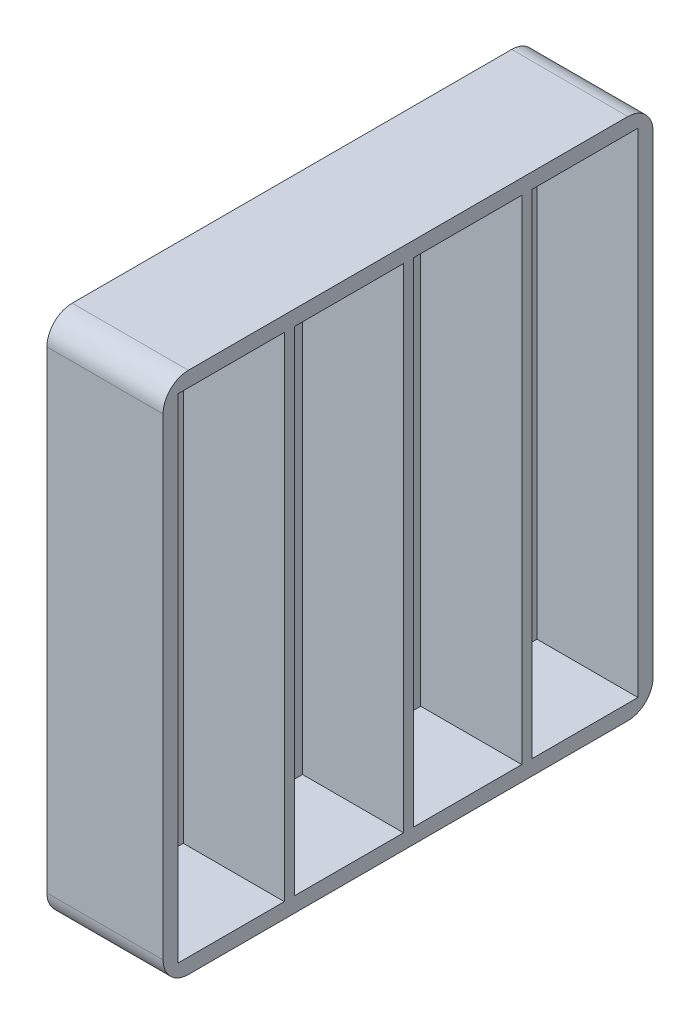
ISO-10303-21;
HEADER;
FILE_DESCRIPTION(('STEP AP214'),'2;1');
FILE_NAME('part.step','',(''),(''),'','','');
FILE_SCHEMA(('AUTOMOTIVE_DESIGN { 1 0 10303 214 1 1 1 1 }'));
ENDSEC;
DATA;
#1=APPLICATION_CONTEXT('core data for automotive mechanical design processes');
#2=APPLICATION_PROTOCOL_DEFINITION('international standard','automotive_design',2000,#1);
#3=PRODUCT_CONTEXT('',#1,'mechanical');
#4=PRODUCT('Part','Part','',(#3));
#5=PRODUCT_RELATED_PRODUCT_CATEGORY('part','',(#4));
#6=PRODUCT_DEFINITION_FORMATION('','',#4);
#7=PRODUCT_DEFINITION_CONTEXT('part definition',#1,'design');
#8=PRODUCT_DEFINITION('design','',#6,#7);
#9=PRODUCT_DEFINITION_SHAPE('','',#8);
#10=(LENGTH_UNIT() NAMED_UNIT(*) SI_UNIT(.MILLI.,.METRE.));
#11=(NAMED_UNIT(*) PLANE_ANGLE_UNIT() SI_UNIT($,.RADIAN.));
#12=(NAMED_UNIT(*) SI_UNIT($,.STERADIAN.) SOLID_ANGLE_UNIT());
#13=UNCERTAINTY_MEASURE_WITH_UNIT(LENGTH_MEASURE(1.E-05),#10,'distance_accuracy_value','');
#14=(GEOMETRIC_REPRESENTATION_CONTEXT(3) GLOBAL_UNCERTAINTY_ASSIGNED_CONTEXT((#13)) GLOBAL_UNIT_ASSIGNED_CONTEXT((#10,
#11,#12)) REPRESENTATION_CONTEXT('',''));
#15=CARTESIAN_POINT('',(0.,0.,0.));
#16=DIRECTION('',(0.,0.,1.));
#17=DIRECTION('',(1.,0.,0.));
#18=AXIS2_PLACEMENT_3D('',#15,#16,#17);
#19=CARTESIAN_POINT('',(1.5,25.9,24.25));
#20=DIRECTION('',(1.,0.,0.));
#21=DIRECTION('',(0.,0.,-1.));
#22=AXIS2_PLACEMENT_3D('',#19,#20,#21);
#23=PLANE('',#22);
#24=DIRECTION('',(0.,1.,0.));
#25=VECTOR('',#24,1.);
#26=CARTESIAN_POINT('',(1.5,1.5,23.7));
#27=LINE('',#26,#25);
#28=CARTESIAN_POINT('',(1.5,1.5,23.7));
#29=VERTEX_POINT('',#28);
#30=CARTESIAN_POINT('',(1.5,50.3,23.7));
#31=VERTEX_POINT('',#30);
#32=EDGE_CURVE('E185',#29,#31,#27,.T.);
#33=ORIENTED_EDGE('',*,*,#32,.F.);
#34=DIRECTION('',(0.,0.,-1.));
#35=VECTOR('',#34,1.);
#36=CARTESIAN_POINT('',(1.5,1.5,48.5));
#37=LINE('',#36,#35);
#38=CARTESIAN_POINT('',(1.5,1.5,13.));
#39=VERTEX_POINT('',#38);
#40=EDGE_CURVE('E192',#29,#39,#37,.T.);
#41=ORIENTED_EDGE('',*,*,#40,.T.);
#42=DIRECTION('',(0.,1.,0.));
#43=VECTOR('',#42,1.);
#44=CARTESIAN_POINT('',(1.5,50.3,13.));
#45=LINE('',#44,#43);
#46=CARTESIAN_POINT('',(1.5,50.3,13.));
#47=VERTEX_POINT('',#46);
#48=EDGE_CURVE('E314',#47,#39,#45,.F.);
#49=ORIENTED_EDGE('',*,*,#48,.F.);
#50=DIRECTION('',(0.,0.,1.));
#51=VECTOR('',#50,1.);
#52=CARTESIAN_POINT('',(1.5,50.3,0.));
#53=LINE('',#52,#51);
#54=EDGE_CURVE('E203',#47,#31,#53,.T.);
#55=ORIENTED_EDGE('',*,*,#54,.T.);
#56=EDGE_LOOP('',(#33,#41,#49,#55));
#57=FACE_BOUND('',#56,.T.);
#58=ADVANCED_FACE('F16',(#57),#23,.T.);
#59=CARTESIAN_POINT('',(1.5,25.9,24.25));
#60=DIRECTION('',(1.,0.,0.));
#61=DIRECTION('',(0.,0.,-1.));
#62=AXIS2_PLACEMENT_3D('',#59,#60,#61);
#63=PLANE('',#62);
#64=DIRECTION('',(0.,1.,0.));
#65=VECTOR('',#64,1.);
#66=CARTESIAN_POINT('',(1.5,51.8,47.));
#67=LINE('',#66,#65);
#68=CARTESIAN_POINT('',(1.5,50.3,47.));
#69=VERTEX_POINT('',#68);
#70=CARTESIAN_POINT('',(1.5,1.5,47.));
#71=VERTEX_POINT('',#70);
#72=EDGE_CURVE('E301',#69,#71,#67,.F.);
#73=ORIENTED_EDGE('',*,*,#72,.T.);
#74=DIRECTION('',(0.,0.,-1.));
#75=VECTOR('',#74,1.);
#76=CARTESIAN_POINT('',(1.5,1.5,48.5));
#77=LINE('',#76,#75);
#78=CARTESIAN_POINT('',(1.5,1.5,36.5));
#79=VERTEX_POINT('',#78);
#80=EDGE_CURVE('E307',#71,#79,#77,.T.);
#81=ORIENTED_EDGE('',*,*,#80,.T.);
#82=DIRECTION('',(0.,1.,0.));
#83=VECTOR('',#82,1.);
#84=CARTESIAN_POINT('',(1.5,50.3,36.5));
#85=LINE('',#84,#83);
#86=CARTESIAN_POINT('',(1.5,50.3,36.5));
#87=VERTEX_POINT('',#86);
#88=EDGE_CURVE('E293',#87,#79,#85,.F.);
#89=ORIENTED_EDGE('',*,*,#88,.F.);
#90=DIRECTION('',(0.,0.,1.));
#91=VECTOR('',#90,1.);
#92=CARTESIAN_POINT('',(1.5,50.3,0.));
#93=LINE('',#92,#91);
#94=EDGE_CURVE('E298',#87,#69,#93,.T.);
#95=ORIENTED_EDGE('',*,*,#94,.T.);
#96=EDGE_LOOP('',(#73,#81,#89,#95));
#97=FACE_BOUND('',#96,.T.);
#98=ADVANCED_FACE('F447',(#97),#63,.T.);
#99=CARTESIAN_POINT('',(1.5,25.9,24.25));
#100=DIRECTION('',(1.,0.,0.));
#101=DIRECTION('',(0.,0.,-1.));
#102=AXIS2_PLACEMENT_3D('',#99,#100,#101);
#103=PLANE('',#102);
#104=DIRECTION('',(0.,1.,0.));
#105=VECTOR('',#104,1.);
#106=CARTESIAN_POINT('',(1.5,0.,1.5));
#107=LINE('',#106,#105);
#108=CARTESIAN_POINT('',(1.5,1.5,1.5));
#109=VERTEX_POINT('',#108);
#110=CARTESIAN_POINT('',(1.5,50.3,1.5));
#111=VERTEX_POINT('',#110);
#112=EDGE_CURVE('E274',#109,#111,#107,.T.);
#113=ORIENTED_EDGE('',*,*,#112,.T.);
#114=DIRECTION('',(0.,0.,1.));
#115=VECTOR('',#114,1.);
#116=CARTESIAN_POINT('',(1.5,50.3,0.));
#117=LINE('',#116,#115);
#118=CARTESIAN_POINT('',(1.5,50.3,12.));
#119=VERTEX_POINT('',#118);
#120=EDGE_CURVE('E283',#111,#119,#117,.T.);
#121=ORIENTED_EDGE('',*,*,#120,.T.);
#122=DIRECTION('',(0.,1.,0.));
#123=VECTOR('',#122,1.);
#124=CARTESIAN_POINT('',(1.5,1.5,12.));
#125=LINE('',#124,#123);
#126=CARTESIAN_POINT('',(1.5,1.5,12.));
#127=VERTEX_POINT('',#126);
#128=EDGE_CURVE('E286',#127,#119,#125,.T.);
#129=ORIENTED_EDGE('',*,*,#128,.F.);
#130=DIRECTION('',(0.,0.,-1.));
#131=VECTOR('',#130,1.);
#132=CARTESIAN_POINT('',(1.5,1.5,48.5));
#133=LINE('',#132,#131);
#134=EDGE_CURVE('E271',#127,#109,#133,.T.);
#135=ORIENTED_EDGE('',*,*,#134,.T.);
#136=EDGE_LOOP('',(#113,#121,#129,#135));
#137=FACE_BOUND('',#136,.T.);
#138=ADVANCED_FACE('F450',(#137),#103,.T.);
#139=CARTESIAN_POINT('',(1.5,25.9,24.25));
#140=DIRECTION('',(1.,0.,0.));
#141=DIRECTION('',(0.,0.,-1.));
#142=AXIS2_PLACEMENT_3D('',#139,#140,#141);
#143=PLANE('',#142);
#144=DIRECTION('',(0.,1.,0.));
#145=VECTOR('',#144,1.);
#146=CARTESIAN_POINT('',(1.5,50.3,24.7));
#147=LINE('',#146,#145);
#148=CARTESIAN_POINT('',(1.5,50.3,24.7));
#149=VERTEX_POINT('',#148);
#150=CARTESIAN_POINT('',(1.5,1.5,24.7));
#151=VERTEX_POINT('',#150);
#152=EDGE_CURVE('E255',#149,#151,#147,.F.);
#153=ORIENTED_EDGE('',*,*,#152,.F.);
#154=DIRECTION('',(0.,0.,1.));
#155=VECTOR('',#154,1.);
#156=CARTESIAN_POINT('',(1.5,50.3,0.));
#157=LINE('',#156,#155);
#158=CARTESIAN_POINT('',(1.5,50.3,35.5));
#159=VERTEX_POINT('',#158);
#160=EDGE_CURVE('E260',#149,#159,#157,.T.);
#161=ORIENTED_EDGE('',*,*,#160,.T.);
#162=DIRECTION('',(0.,1.,0.));
#163=VECTOR('',#162,1.);
#164=CARTESIAN_POINT('',(1.5,1.5,35.5));
#165=LINE('',#164,#163);
#166=CARTESIAN_POINT('',(1.5,1.5,35.5));
#167=VERTEX_POINT('',#166);
#168=EDGE_CURVE('E263',#167,#159,#165,.T.);
#169=ORIENTED_EDGE('',*,*,#168,.F.);
#170=DIRECTION('',(0.,0.,-1.));
#171=VECTOR('',#170,1.);
#172=CARTESIAN_POINT('',(1.5,1.5,48.5));
#173=LINE('',#172,#171);
#174=EDGE_CURVE('E249',#167,#151,#173,.T.);
#175=ORIENTED_EDGE('',*,*,#174,.T.);
#176=EDGE_LOOP('',(#153,#161,#169,#175));
#177=FACE_BOUND('',#176,.T.);
#178=ADVANCED_FACE('F455',(#177),#143,.T.);
#179=CARTESIAN_POINT('',(0.,1.5,48.5));
#180=DIRECTION('',(0.,-1.,0.));
#181=DIRECTION('',(0.,0.,-1.));
#182=AXIS2_PLACEMENT_3D('',#179,#180,#181);
#183=PLANE('',#182);
#184=ORIENTED_EDGE('',*,*,#40,.F.);
#185=DIRECTION('',(-1.,0.,0.));
#186=VECTOR('',#185,1.);
#187=CARTESIAN_POINT('',(1.5,1.5,23.7));
#188=LINE('',#187,#186);
#189=CARTESIAN_POINT('',(11.5,1.5,23.7));
#190=VERTEX_POINT('',#189);
#191=EDGE_CURVE('E195',#190,#29,#188,.T.);
#192=ORIENTED_EDGE('',*,*,#191,.F.);
#193=DIRECTION('',(0.,0.,-1.));
#194=VECTOR('',#193,1.);
#195=CARTESIAN_POINT('',(11.5,1.5,24.25));
#196=LINE('',#195,#194);
#197=CARTESIAN_POINT('',(11.5,1.5,13.));
#198=VERTEX_POINT('',#197);
#199=EDGE_CURVE('E246',#198,#190,#196,.F.);
#200=ORIENTED_EDGE('',*,*,#199,.F.);
#201=DIRECTION('',(1.,0.,0.));
#202=VECTOR('',#201,1.);
#203=CARTESIAN_POINT('',(1.5,1.5,13.));
#204=LINE('',#203,#202);
#205=EDGE_CURVE('E197',#39,#198,#204,.T.);
#206=ORIENTED_EDGE('',*,*,#205,.F.);
#207=EDGE_LOOP('',(#184,#192,#200,#206));
#208=FACE_BOUND('',#207,.T.);
#209=ADVANCED_FACE('F193',(#208),#183,.F.);
#210=CARTESIAN_POINT('',(1.5,1.5,23.7));
#211=DIRECTION('',(0.,0.,-1.));
#212=DIRECTION('',(-1.,0.,0.));
#213=AXIS2_PLACEMENT_3D('',#210,#211,#212);
#214=PLANE('',#213);
#215=DIRECTION('',(0.,1.,0.));
#216=VECTOR('',#215,1.);
#217=CARTESIAN_POINT('',(11.5,25.9,23.7));
#218=LINE('',#217,#216);
#219=CARTESIAN_POINT('',(11.5,50.3,23.7));
#220=VERTEX_POINT('',#219);
#221=EDGE_CURVE('E202',#190,#220,#218,.T.);
#222=ORIENTED_EDGE('',*,*,#221,.F.);
#223=ORIENTED_EDGE('',*,*,#191,.T.);
#224=ORIENTED_EDGE('',*,*,#32,.T.);
#225=DIRECTION('',(1.,0.,0.));
#226=VECTOR('',#225,1.);
#227=CARTESIAN_POINT('',(0.,50.3,23.7));
#228=LINE('',#227,#226);
#229=EDGE_CURVE('E316',#31,#220,#228,.T.);
#230=ORIENTED_EDGE('',*,*,#229,.T.);
#231=EDGE_LOOP('',(#222,#223,#224,#230));
#232=FACE_BOUND('',#231,.T.);
#233=ADVANCED_FACE('F201',(#232),#214,.T.);
#234=CARTESIAN_POINT('',(0.,50.3,0.));
#235=DIRECTION('',(0.,1.,0.));
#236=DIRECTION('',(0.,0.,1.));
#237=AXIS2_PLACEMENT_3D('',#234,#235,#236);
#238=PLANE('',#237);
#239=DIRECTION('',(0.,0.,-1.));
#240=VECTOR('',#239,1.);
#241=CARTESIAN_POINT('',(11.5,50.3,24.25));
#242=LINE('',#241,#240);
#243=CARTESIAN_POINT('',(11.5,50.3,13.));
#244=VERTEX_POINT('',#243);
#245=EDGE_CURVE('E320',#220,#244,#242,.T.);
#246=ORIENTED_EDGE('',*,*,#245,.F.);
#247=ORIENTED_EDGE('',*,*,#229,.F.);
#248=ORIENTED_EDGE('',*,*,#54,.F.);
#249=DIRECTION('',(1.,0.,0.));
#250=VECTOR('',#249,1.);
#251=CARTESIAN_POINT('',(1.5,50.3,13.));
#252=LINE('',#251,#250);
#253=EDGE_CURVE('E310',#244,#47,#252,.F.);
#254=ORIENTED_EDGE('',*,*,#253,.F.);
#255=EDGE_LOOP('',(#246,#247,#248,#254));
#256=FACE_BOUND('',#255,.T.);
#257=ADVANCED_FACE('F321',(#256),#238,.F.);
#258=CARTESIAN_POINT('',(1.5,50.3,13.));
#259=DIRECTION('',(0.,0.,1.));
#260=DIRECTION('',(1.,0.,0.));
#261=AXIS2_PLACEMENT_3D('',#258,#259,#260);
#262=PLANE('',#261);
#263=DIRECTION('',(0.,1.,0.));
#264=VECTOR('',#263,1.);
#265=CARTESIAN_POINT('',(11.5,25.9,13.));
#266=LINE('',#265,#264);
#267=EDGE_CURVE('E325',#244,#198,#266,.F.);
#268=ORIENTED_EDGE('',*,*,#267,.F.);
#269=ORIENTED_EDGE('',*,*,#253,.T.);
#270=ORIENTED_EDGE('',*,*,#48,.T.);
#271=ORIENTED_EDGE('',*,*,#205,.T.);
#272=EDGE_LOOP('',(#268,#269,#270,#271));
#273=FACE_BOUND('',#272,.T.);
#274=ADVANCED_FACE('F333',(#273),#262,.T.);
#275=CARTESIAN_POINT('',(0.,1.5,48.5));
#276=DIRECTION('',(0.,-1.,0.));
#277=DIRECTION('',(0.,0.,-1.));
#278=AXIS2_PLACEMENT_3D('',#275,#276,#277);
#279=PLANE('',#278);
#280=ORIENTED_EDGE('',*,*,#80,.F.);
#281=DIRECTION('',(1.,0.,0.));
#282=VECTOR('',#281,1.);
#283=CARTESIAN_POINT('',(0.,1.5,47.));
#284=LINE('',#283,#282);
#285=CARTESIAN_POINT('',(11.5,1.5,47.));
#286=VERTEX_POINT('',#285);
#287=EDGE_CURVE('E304',#71,#286,#284,.T.);
#288=ORIENTED_EDGE('',*,*,#287,.T.);
#289=DIRECTION('',(0.,0.,-1.));
#290=VECTOR('',#289,1.);
#291=CARTESIAN_POINT('',(11.5,1.5,24.25));
#292=LINE('',#291,#290);
#293=CARTESIAN_POINT('',(11.5,1.5,36.5));
#294=VERTEX_POINT('',#293);
#295=EDGE_CURVE('E327',#294,#286,#292,.F.);
#296=ORIENTED_EDGE('',*,*,#295,.F.);
#297=DIRECTION('',(1.,0.,0.));
#298=VECTOR('',#297,1.);
#299=CARTESIAN_POINT('',(1.5,1.5,36.5));
#300=LINE('',#299,#298);
#301=EDGE_CURVE('E291',#79,#294,#300,.T.);
#302=ORIENTED_EDGE('',*,*,#301,.F.);
#303=EDGE_LOOP('',(#280,#288,#296,#302));
#304=FACE_BOUND('',#303,.T.);
#305=ADVANCED_FACE('F335',(#304),#279,.F.);
#306=CARTESIAN_POINT('',(0.,51.8,47.));
#307=DIRECTION('',(0.,0.,1.));
#308=DIRECTION('',(1.,0.,0.));
#309=AXIS2_PLACEMENT_3D('',#306,#307,#308);
#310=PLANE('',#309);
#311=DIRECTION('',(1.,0.,0.));
#312=VECTOR('',#311,1.);
#313=CARTESIAN_POINT('',(0.,50.3,47.));
#314=LINE('',#313,#312);
#315=CARTESIAN_POINT('',(11.5,50.3,47.));
#316=VERTEX_POINT('',#315);
#317=EDGE_CURVE('E295',#69,#316,#314,.T.);
#318=ORIENTED_EDGE('',*,*,#317,.T.);
#319=DIRECTION('',(0.,1.,0.));
#320=VECTOR('',#319,1.);
#321=CARTESIAN_POINT('',(11.5,25.9,47.));
#322=LINE('',#321,#320);
#323=EDGE_CURVE('E432',#286,#316,#322,.T.);
#324=ORIENTED_EDGE('',*,*,#323,.F.);
#325=ORIENTED_EDGE('',*,*,#287,.F.);
#326=ORIENTED_EDGE('',*,*,#72,.F.);
#327=EDGE_LOOP('',(#318,#324,#325,#326));
#328=FACE_BOUND('',#327,.T.);
#329=ADVANCED_FACE('F342',(#328),#310,.F.);
#330=CARTESIAN_POINT('',(0.,50.3,0.));
#331=DIRECTION('',(0.,1.,0.));
#332=DIRECTION('',(0.,0.,1.));
#333=AXIS2_PLACEMENT_3D('',#330,#331,#332);
#334=PLANE('',#333);
#335=DIRECTION('',(0.,0.,-1.));
#336=VECTOR('',#335,1.);
#337=CARTESIAN_POINT('',(11.5,50.3,24.25));
#338=LINE('',#337,#336);
#339=CARTESIAN_POINT('',(11.5,50.3,36.5));
#340=VERTEX_POINT('',#339);
#341=EDGE_CURVE('E434',#316,#340,#338,.T.);
#342=ORIENTED_EDGE('',*,*,#341,.F.);
#343=ORIENTED_EDGE('',*,*,#317,.F.);
#344=ORIENTED_EDGE('',*,*,#94,.F.);
#345=DIRECTION('',(1.,0.,0.));
#346=VECTOR('',#345,1.);
#347=CARTESIAN_POINT('',(1.5,50.3,36.5));
#348=LINE('',#347,#346);
#349=EDGE_CURVE('E288',#340,#87,#348,.F.);
#350=ORIENTED_EDGE('',*,*,#349,.F.);
#351=EDGE_LOOP('',(#342,#343,#344,#350));
#352=FACE_BOUND('',#351,.T.);
#353=ADVANCED_FACE('F419',(#352),#334,.F.);
#354=CARTESIAN_POINT('',(1.5,50.3,36.5));
#355=DIRECTION('',(0.,0.,1.));
#356=DIRECTION('',(1.,0.,0.));
#357=AXIS2_PLACEMENT_3D('',#354,#355,#356);
#358=PLANE('',#357);
#359=DIRECTION('',(0.,1.,0.));
#360=VECTOR('',#359,1.);
#361=CARTESIAN_POINT('',(11.5,25.9,36.5));
#362=LINE('',#361,#360);
#363=EDGE_CURVE('E438',#340,#294,#362,.F.);
#364=ORIENTED_EDGE('',*,*,#363,.F.);
#365=ORIENTED_EDGE('',*,*,#349,.T.);
#366=ORIENTED_EDGE('',*,*,#88,.T.);
#367=ORIENTED_EDGE('',*,*,#301,.T.);
#368=EDGE_LOOP('',(#364,#365,#366,#367));
#369=FACE_BOUND('',#368,.T.);
#370=ADVANCED_FACE('F415',(#369),#358,.T.);
#371=CARTESIAN_POINT('',(1.5,1.5,12.));
#372=DIRECTION('',(0.,0.,-1.));
#373=DIRECTION('',(-1.,0.,0.));
#374=AXIS2_PLACEMENT_3D('',#371,#372,#373);
#375=PLANE('',#374);
#376=DIRECTION('',(0.,1.,0.));
#377=VECTOR('',#376,1.);
#378=CARTESIAN_POINT('',(11.5,25.9,12.));
#379=LINE('',#378,#377);
#380=CARTESIAN_POINT('',(11.5,1.5,12.));
#381=VERTEX_POINT('',#380);
#382=CARTESIAN_POINT('',(11.5,50.3,12.));
#383=VERTEX_POINT('',#382);
#384=EDGE_CURVE('E440',#381,#383,#379,.T.);
#385=ORIENTED_EDGE('',*,*,#384,.F.);
#386=DIRECTION('',(1.,0.,0.));
#387=VECTOR('',#386,1.);
#388=CARTESIAN_POINT('',(0.,1.5,12.));
#389=LINE('',#388,#387);
#390=EDGE_CURVE('E265',#381,#127,#389,.F.);
#391=ORIENTED_EDGE('',*,*,#390,.T.);
#392=ORIENTED_EDGE('',*,*,#128,.T.);
#393=DIRECTION('',(1.,0.,0.));
#394=VECTOR('',#393,1.);
#395=CARTESIAN_POINT('',(0.,50.3,12.));
#396=LINE('',#395,#394);
#397=EDGE_CURVE('E280',#119,#383,#396,.T.);
#398=ORIENTED_EDGE('',*,*,#397,.T.);
#399=EDGE_LOOP('',(#385,#391,#392,#398));
#400=FACE_BOUND('',#399,.T.);
#401=ADVANCED_FACE('F411',(#400),#375,.T.);
#402=CARTESIAN_POINT('',(0.,50.3,0.));
#403=DIRECTION('',(0.,1.,0.));
#404=DIRECTION('',(0.,0.,1.));
#405=AXIS2_PLACEMENT_3D('',#402,#403,#404);
#406=PLANE('',#405);
#407=ORIENTED_EDGE('',*,*,#120,.F.);
#408=DIRECTION('',(-1.,0.,0.));
#409=VECTOR('',#408,1.);
#410=CARTESIAN_POINT('',(0.,50.3,1.5));
#411=LINE('',#410,#409);
#412=CARTESIAN_POINT('',(11.5,50.3,1.5));
#413=VERTEX_POINT('',#412);
#414=EDGE_CURVE('E277',#111,#413,#411,.F.);
#415=ORIENTED_EDGE('',*,*,#414,.T.);
#416=DIRECTION('',(0.,0.,-1.));
#417=VECTOR('',#416,1.);
#418=CARTESIAN_POINT('',(11.5,50.3,24.25));
#419=LINE('',#418,#417);
#420=EDGE_CURVE('E667',#383,#413,#419,.T.);
#421=ORIENTED_EDGE('',*,*,#420,.F.);
#422=ORIENTED_EDGE('',*,*,#397,.F.);
#423=EDGE_LOOP('',(#407,#415,#421,#422));
#424=FACE_BOUND('',#423,.T.);
#425=ADVANCED_FACE('F407',(#424),#406,.F.);
#426=CARTESIAN_POINT('',(0.,0.,1.5));
#427=DIRECTION('',(0.,0.,-1.));
#428=DIRECTION('',(-1.,0.,0.));
#429=AXIS2_PLACEMENT_3D('',#426,#427,#428);
#430=PLANE('',#429);
#431=DIRECTION('',(1.,0.,0.));
#432=VECTOR('',#431,1.);
#433=CARTESIAN_POINT('',(0.,1.5,1.5));
#434=LINE('',#433,#432);
#435=CARTESIAN_POINT('',(11.5,1.5,1.5));
#436=VERTEX_POINT('',#435);
#437=EDGE_CURVE('E268',#109,#436,#434,.T.);
#438=ORIENTED_EDGE('',*,*,#437,.T.);
#439=DIRECTION('',(0.,1.,0.));
#440=VECTOR('',#439,1.);
#441=CARTESIAN_POINT('',(11.5,25.9,1.5));
#442=LINE('',#441,#440);
#443=EDGE_CURVE('E665',#413,#436,#442,.F.);
#444=ORIENTED_EDGE('',*,*,#443,.F.);
#445=ORIENTED_EDGE('',*,*,#414,.F.);
#446=ORIENTED_EDGE('',*,*,#112,.F.);
#447=EDGE_LOOP('',(#438,#444,#445,#446));
#448=FACE_BOUND('',#447,.T.);
#449=ADVANCED_FACE('F403',(#448),#430,.F.);
#450=CARTESIAN_POINT('',(0.,1.5,48.5));
#451=DIRECTION('',(0.,-1.,0.));
#452=DIRECTION('',(0.,0.,-1.));
#453=AXIS2_PLACEMENT_3D('',#450,#451,#452);
#454=PLANE('',#453);
#455=DIRECTION('',(0.,0.,-1.));
#456=VECTOR('',#455,1.);
#457=CARTESIAN_POINT('',(11.5,1.5,24.25));
#458=LINE('',#457,#456);
#459=EDGE_CURVE('E662',#436,#381,#458,.F.);
#460=ORIENTED_EDGE('',*,*,#459,.F.);
#461=ORIENTED_EDGE('',*,*,#437,.F.);
#462=ORIENTED_EDGE('',*,*,#134,.F.);
#463=ORIENTED_EDGE('',*,*,#390,.F.);
#464=EDGE_LOOP('',(#460,#461,#462,#463));
#465=FACE_BOUND('',#464,.T.);
#466=ADVANCED_FACE('F399',(#465),#454,.F.);
#467=CARTESIAN_POINT('',(1.5,1.5,35.5));
#468=DIRECTION('',(0.,0.,-1.));
#469=DIRECTION('',(-1.,0.,0.));
#470=AXIS2_PLACEMENT_3D('',#467,#468,#469);
#471=PLANE('',#470);
#472=DIRECTION('',(0.,1.,0.));
#473=VECTOR('',#472,1.);
#474=CARTESIAN_POINT('',(11.5,25.9,35.5));
#475=LINE('',#474,#473);
#476=CARTESIAN_POINT('',(11.5,1.5,35.5));
#477=VERTEX_POINT('',#476);
#478=CARTESIAN_POINT('',(11.5,50.3,35.5));
#479=VERTEX_POINT('',#478);
#480=EDGE_CURVE('E660',#477,#479,#475,.T.);
#481=ORIENTED_EDGE('',*,*,#480,.F.);
#482=DIRECTION('',(1.,0.,0.));
#483=VECTOR('',#482,1.);
#484=CARTESIAN_POINT('',(0.,1.5,35.5));
#485=LINE('',#484,#483);
#486=EDGE_CURVE('E243',#477,#167,#485,.F.);
#487=ORIENTED_EDGE('',*,*,#486,.T.);
#488=ORIENTED_EDGE('',*,*,#168,.T.);
#489=DIRECTION('',(1.,0.,0.));
#490=VECTOR('',#489,1.);
#491=CARTESIAN_POINT('',(0.,50.3,35.5));
#492=LINE('',#491,#490);
#493=EDGE_CURVE('E257',#159,#479,#492,.T.);
#494=ORIENTED_EDGE('',*,*,#493,.T.);
#495=EDGE_LOOP('',(#481,#487,#488,#494));
#496=FACE_BOUND('',#495,.T.);
#497=ADVANCED_FACE('F395',(#496),#471,.T.);
#498=CARTESIAN_POINT('',(0.,50.3,0.));
#499=DIRECTION('',(0.,1.,0.));
#500=DIRECTION('',(0.,0.,1.));
#501=AXIS2_PLACEMENT_3D('',#498,#499,#500);
#502=PLANE('',#501);
#503=ORIENTED_EDGE('',*,*,#160,.F.);
#504=DIRECTION('',(1.,0.,0.));
#505=VECTOR('',#504,1.);
#506=CARTESIAN_POINT('',(1.5,50.3,24.7));
#507=LINE('',#506,#505);
#508=CARTESIAN_POINT('',(11.5,50.3,24.7));
#509=VERTEX_POINT('',#508);
#510=EDGE_CURVE('E252',#509,#149,#507,.F.);
#511=ORIENTED_EDGE('',*,*,#510,.F.);
#512=DIRECTION('',(0.,0.,-1.));
#513=VECTOR('',#512,1.);
#514=CARTESIAN_POINT('',(11.5,50.3,24.25));
#515=LINE('',#514,#513);
#516=EDGE_CURVE('E654',#479,#509,#515,.T.);
#517=ORIENTED_EDGE('',*,*,#516,.F.);
#518=ORIENTED_EDGE('',*,*,#493,.F.);
#519=EDGE_LOOP('',(#503,#511,#517,#518));
#520=FACE_BOUND('',#519,.T.);
#521=ADVANCED_FACE('F391',(#520),#502,.F.);
#522=CARTESIAN_POINT('',(1.5,50.3,24.7));
#523=DIRECTION('',(0.,0.,1.));
#524=DIRECTION('',(1.,0.,0.));
#525=AXIS2_PLACEMENT_3D('',#522,#523,#524);
#526=PLANE('',#525);
#527=DIRECTION('',(0.,1.,0.));
#528=VECTOR('',#527,1.);
#529=CARTESIAN_POINT('',(11.5,25.9,24.7));
#530=LINE('',#529,#528);
#531=CARTESIAN_POINT('',(11.5,1.5,24.7));
#532=VERTEX_POINT('',#531);
#533=EDGE_CURVE('E92',#509,#532,#530,.F.);
#534=ORIENTED_EDGE('',*,*,#533,.F.);
#535=ORIENTED_EDGE('',*,*,#510,.T.);
#536=ORIENTED_EDGE('',*,*,#152,.T.);
#537=DIRECTION('',(1.,0.,0.));
#538=VECTOR('',#537,1.);
#539=CARTESIAN_POINT('',(0.,1.5,24.7));
#540=LINE('',#539,#538);
#541=EDGE_CURVE('E247',#151,#532,#540,.T.);
#542=ORIENTED_EDGE('',*,*,#541,.T.);
#543=EDGE_LOOP('',(#534,#535,#536,#542));
#544=FACE_BOUND('',#543,.T.);
#545=ADVANCED_FACE('F387',(#544),#526,.T.);
#546=CARTESIAN_POINT('',(0.,1.5,48.5));
#547=DIRECTION('',(0.,-1.,0.));
#548=DIRECTION('',(0.,0.,-1.));
#549=AXIS2_PLACEMENT_3D('',#546,#547,#548);
#550=PLANE('',#549);
#551=DIRECTION('',(0.,0.,-1.));
#552=VECTOR('',#551,1.);
#553=CARTESIAN_POINT('',(11.5,1.5,24.25));
#554=LINE('',#553,#552);
#555=EDGE_CURVE('E649',#532,#477,#554,.F.);
#556=ORIENTED_EDGE('',*,*,#555,.F.);
#557=ORIENTED_EDGE('',*,*,#541,.F.);
#558=ORIENTED_EDGE('',*,*,#174,.F.);
#559=ORIENTED_EDGE('',*,*,#486,.F.);
#560=EDGE_LOOP('',(#556,#557,#558,#559));
#561=FACE_BOUND('',#560,.T.);
#562=ADVANCED_FACE('F384',(#561),#550,.F.);
#563=CARTESIAN_POINT('',(11.5,25.9,24.25));
#564=DIRECTION('',(1.,0.,0.));
#565=DIRECTION('',(0.,0.,-1.));
#566=AXIS2_PLACEMENT_3D('',#563,#564,#565);
#567=PLANE('',#566);
#568=ORIENTED_EDGE('',*,*,#533,.T.);
#569=ORIENTED_EDGE('',*,*,#555,.T.);
#570=ORIENTED_EDGE('',*,*,#480,.T.);
#571=ORIENTED_EDGE('',*,*,#516,.T.);
#572=EDGE_LOOP('',(#568,#569,#570,#571));
#573=FACE_BOUND('',#572,.T.);
#574=ORIENTED_EDGE('',*,*,#443,.T.);
#575=ORIENTED_EDGE('',*,*,#459,.T.);
#576=ORIENTED_EDGE('',*,*,#384,.T.);
#577=ORIENTED_EDGE('',*,*,#420,.T.);
#578=EDGE_LOOP('',(#574,#575,#576,#577));
#579=FACE_BOUND('',#578,.T.);
#580=ORIENTED_EDGE('',*,*,#341,.T.);
#581=ORIENTED_EDGE('',*,*,#363,.T.);
#582=ORIENTED_EDGE('',*,*,#295,.T.);
#583=ORIENTED_EDGE('',*,*,#323,.T.);
#584=EDGE_LOOP('',(#580,#581,#582,#583));
#585=FACE_BOUND('',#584,.T.);
#586=ORIENTED_EDGE('',*,*,#245,.T.);
#587=ORIENTED_EDGE('',*,*,#267,.T.);
#588=ORIENTED_EDGE('',*,*,#199,.T.);
#589=ORIENTED_EDGE('',*,*,#221,.T.);
#590=EDGE_LOOP('',(#586,#587,#588,#589));
#591=FACE_BOUND('',#590,.T.);
#592=CARTESIAN_POINT('',(11.5,49.3,46.));
#593=DIRECTION('',(1.,0.,0.));
#594=DIRECTION('',(0.,0.,-1.));
#595=AXIS2_PLACEMENT_3D('',#592,#593,#594);
#596=CIRCLE('',#595,2.5);
#597=CARTESIAN_POINT('',(11.5,49.3,48.5));
#598=VERTEX_POINT('',#597);
#599=CARTESIAN_POINT('',(11.5,51.8,46.));
#600=VERTEX_POINT('',#599);
#601=EDGE_CURVE('E224',#598,#600,#596,.F.);
#602=ORIENTED_EDGE('',*,*,#601,.F.);
#603=DIRECTION('',(0.,1.,0.));
#604=VECTOR('',#603,1.);
#605=CARTESIAN_POINT('',(11.5,51.8,48.5));
#606=LINE('',#605,#604);
#607=CARTESIAN_POINT('',(11.5,2.5,48.5));
#608=VERTEX_POINT('',#607);
#609=EDGE_CURVE('E657',#608,#598,#606,.T.);
#610=ORIENTED_EDGE('',*,*,#609,.F.);
#611=CARTESIAN_POINT('',(11.5,2.5,46.));
#612=DIRECTION('',(1.,0.,0.));
#613=DIRECTION('',(0.,0.,-1.));
#614=AXIS2_PLACEMENT_3D('',#611,#612,#613);
#615=CIRCLE('',#614,2.5);
#616=CARTESIAN_POINT('',(11.5,0.,46.));
#617=VERTEX_POINT('',#616);
#618=EDGE_CURVE('E221',#617,#608,#615,.F.);
#619=ORIENTED_EDGE('',*,*,#618,.F.);
#620=DIRECTION('',(0.,0.,-1.));
#621=VECTOR('',#620,1.);
#622=CARTESIAN_POINT('',(11.5,0.,48.5));
#623=LINE('',#622,#621);
#624=CARTESIAN_POINT('',(11.5,0.,2.5));
#625=VERTEX_POINT('',#624);
#626=EDGE_CURVE('E651',#625,#617,#623,.F.);
#627=ORIENTED_EDGE('',*,*,#626,.F.);
#628=CARTESIAN_POINT('',(11.5,2.5,2.5));
#629=DIRECTION('',(1.,0.,0.));
#630=DIRECTION('',(0.,0.,-1.));
#631=AXIS2_PLACEMENT_3D('',#628,#629,#630);
#632=CIRCLE('',#631,2.5);
#633=CARTESIAN_POINT('',(11.5,2.5,0.));
#634=VERTEX_POINT('',#633);
#635=EDGE_CURVE('E19',#634,#625,#632,.F.);
#636=ORIENTED_EDGE('',*,*,#635,.F.);
#637=DIRECTION('',(0.,1.,0.));
#638=VECTOR('',#637,1.);
#639=CARTESIAN_POINT('',(11.5,0.,0.));
#640=LINE('',#639,#638);
#641=CARTESIAN_POINT('',(11.5,49.3,0.));
#642=VERTEX_POINT('',#641);
#643=EDGE_CURVE('E229',#642,#634,#640,.F.);
#644=ORIENTED_EDGE('',*,*,#643,.F.);
#645=CARTESIAN_POINT('',(11.5,49.3,2.5));
#646=DIRECTION('',(1.,0.,0.));
#647=DIRECTION('',(0.,0.,-1.));
#648=AXIS2_PLACEMENT_3D('',#645,#646,#647);
#649=CIRCLE('',#648,2.5);
#650=CARTESIAN_POINT('',(11.5,51.8,2.5));
#651=VERTEX_POINT('',#650);
#652=EDGE_CURVE('E227',#651,#642,#649,.F.);
#653=ORIENTED_EDGE('',*,*,#652,.F.);
#654=DIRECTION('',(0.,0.,1.));
#655=VECTOR('',#654,1.);
#656=CARTESIAN_POINT('',(11.5,51.8,0.));
#657=LINE('',#656,#655);
#658=EDGE_CURVE('E226',#600,#651,#657,.F.);
#659=ORIENTED_EDGE('',*,*,#658,.F.);
#660=EDGE_LOOP('',(#602,#610,#619,#627,#636,#644,#653,#659));
#661=FACE_BOUND('',#660,.T.);
#662=ADVANCED_FACE('F331',(#573,#579,#585,#591,#661),#567,.T.);
#663=CARTESIAN_POINT('',(0.,0.,48.5));
#664=DIRECTION('',(0.,-1.,0.));
#665=DIRECTION('',(0.,0.,-1.));
#666=AXIS2_PLACEMENT_3D('',#663,#664,#665);
#667=PLANE('',#666);
#668=DIRECTION('',(1.,0.,0.));
#669=VECTOR('',#668,1.);
#670=CARTESIAN_POINT('',(0.,0.,2.5));
#671=LINE('',#670,#669);
#672=CARTESIAN_POINT('',(0.,0.,2.5));
#673=VERTEX_POINT('',#672);
#674=EDGE_CURVE('E238',#625,#673,#671,.F.);
#675=ORIENTED_EDGE('',*,*,#674,.F.);
#676=ORIENTED_EDGE('',*,*,#626,.T.);
#677=DIRECTION('',(1.,0.,0.));
#678=VECTOR('',#677,1.);
#679=CARTESIAN_POINT('',(0.,0.,46.));
#680=LINE('',#679,#678);
#681=CARTESIAN_POINT('',(0.,0.,46.));
#682=VERTEX_POINT('',#681);
#683=EDGE_CURVE('E684',#682,#617,#680,.T.);
#684=ORIENTED_EDGE('',*,*,#683,.F.);
#685=DIRECTION('',(0.,0.,-1.));
#686=VECTOR('',#685,1.);
#687=CARTESIAN_POINT('',(0.,0.,24.25));
#688=LINE('',#687,#686);
#689=EDGE_CURVE('E220',#682,#673,#688,.T.);
#690=ORIENTED_EDGE('',*,*,#689,.T.);
#691=EDGE_LOOP('',(#675,#676,#684,#690));
#692=FACE_BOUND('',#691,.T.);
#693=ADVANCED_FACE('F378',(#692),#667,.T.);
#694=CARTESIAN_POINT('',(0.,2.5,2.5));
#695=DIRECTION('',(1.,0.,0.));
#696=DIRECTION('',(0.,0.,-1.));
#697=AXIS2_PLACEMENT_3D('',#694,#695,#696);
#698=CYLINDRICAL_SURFACE('',#697,2.5);
#699=CARTESIAN_POINT('',(0.,2.5,2.5));
#700=DIRECTION('',(1.,0.,0.));
#701=DIRECTION('',(0.,0.,-1.));
#702=AXIS2_PLACEMENT_3D('',#699,#700,#701);
#703=CIRCLE('',#702,2.5);
#704=CARTESIAN_POINT('',(0.,2.5,0.));
#705=VERTEX_POINT('',#704);
#706=EDGE_CURVE('E217',#673,#705,#703,.T.);
#707=ORIENTED_EDGE('',*,*,#706,.T.);
#708=DIRECTION('',(-1.,0.,0.));
#709=VECTOR('',#708,1.);
#710=CARTESIAN_POINT('',(0.,2.5,0.));
#711=LINE('',#710,#709);
#712=EDGE_CURVE('E234',#634,#705,#711,.T.);
#713=ORIENTED_EDGE('',*,*,#712,.F.);
#714=ORIENTED_EDGE('',*,*,#635,.T.);
#715=ORIENTED_EDGE('',*,*,#674,.T.);
#716=EDGE_LOOP('',(#707,#713,#714,#715));
#717=FACE_BOUND('',#716,.T.);
#718=ADVANCED_FACE('F375',(#717),#698,.T.);
#719=CARTESIAN_POINT('',(0.,0.,0.));
#720=DIRECTION('',(0.,0.,-1.));
#721=DIRECTION('',(-1.,0.,0.));
#722=AXIS2_PLACEMENT_3D('',#719,#720,#721);
#723=PLANE('',#722);
#724=DIRECTION('',(1.,0.,0.));
#725=VECTOR('',#724,1.);
#726=CARTESIAN_POINT('',(0.,49.3,0.));
#727=LINE('',#726,#725);
#728=CARTESIAN_POINT('',(0.,49.3,0.));
#729=VERTEX_POINT('',#728);
#730=EDGE_CURVE('E228',#642,#729,#727,.F.);
#731=ORIENTED_EDGE('',*,*,#730,.F.);
#732=ORIENTED_EDGE('',*,*,#643,.T.);
#733=ORIENTED_EDGE('',*,*,#712,.T.);
#734=DIRECTION('',(0.,1.,0.));
#735=VECTOR('',#734,1.);
#736=CARTESIAN_POINT('',(0.,25.9,0.));
#737=LINE('',#736,#735);
#738=EDGE_CURVE('E216',#705,#729,#737,.T.);
#739=ORIENTED_EDGE('',*,*,#738,.T.);
#740=EDGE_LOOP('',(#731,#732,#733,#739));
#741=FACE_BOUND('',#740,.T.);
#742=ADVANCED_FACE('F372',(#741),#723,.T.);
#743=CARTESIAN_POINT('',(0.,49.3,2.5));
#744=DIRECTION('',(1.,0.,0.));
#745=DIRECTION('',(0.,0.,-1.));
#746=AXIS2_PLACEMENT_3D('',#743,#744,#745);
#747=CYLINDRICAL_SURFACE('',#746,2.5);
#748=CARTESIAN_POINT('',(0.,49.3,2.5));
#749=DIRECTION('',(1.,0.,0.));
#750=DIRECTION('',(0.,0.,-1.));
#751=AXIS2_PLACEMENT_3D('',#748,#749,#750);
#752=CIRCLE('',#751,2.5);
#753=CARTESIAN_POINT('',(0.,51.8,2.5));
#754=VERTEX_POINT('',#753);
#755=EDGE_CURVE('E213',#729,#754,#752,.T.);
#756=ORIENTED_EDGE('',*,*,#755,.T.);
#757=DIRECTION('',(1.,0.,0.));
#758=VECTOR('',#757,1.);
#759=CARTESIAN_POINT('',(0.,51.8,2.5));
#760=LINE('',#759,#758);
#761=EDGE_CURVE('E232',#651,#754,#760,.F.);
#762=ORIENTED_EDGE('',*,*,#761,.F.);
#763=ORIENTED_EDGE('',*,*,#652,.T.);
#764=ORIENTED_EDGE('',*,*,#730,.T.);
#765=EDGE_LOOP('',(#756,#762,#763,#764));
#766=FACE_BOUND('',#765,.T.);
#767=ADVANCED_FACE('F368',(#766),#747,.T.);
#768=CARTESIAN_POINT('',(0.,51.8,0.));
#769=DIRECTION('',(0.,1.,0.));
#770=DIRECTION('',(0.,0.,1.));
#771=AXIS2_PLACEMENT_3D('',#768,#769,#770);
#772=PLANE('',#771);
#773=DIRECTION('',(1.,0.,0.));
#774=VECTOR('',#773,1.);
#775=CARTESIAN_POINT('',(0.,51.8,46.));
#776=LINE('',#775,#774);
#777=CARTESIAN_POINT('',(0.,51.8,46.));
#778=VERTEX_POINT('',#777);
#779=EDGE_CURVE('E225',#600,#778,#776,.F.);
#780=ORIENTED_EDGE('',*,*,#779,.F.);
#781=ORIENTED_EDGE('',*,*,#658,.T.);
#782=ORIENTED_EDGE('',*,*,#761,.T.);
#783=DIRECTION('',(0.,0.,-1.));
#784=VECTOR('',#783,1.);
#785=CARTESIAN_POINT('',(0.,51.8,24.25));
#786=LINE('',#785,#784);
#787=EDGE_CURVE('E212',#754,#778,#786,.F.);
#788=ORIENTED_EDGE('',*,*,#787,.T.);
#789=EDGE_LOOP('',(#780,#781,#782,#788));
#790=FACE_BOUND('',#789,.T.);
#791=ADVANCED_FACE('F364',(#790),#772,.T.);
#792=CARTESIAN_POINT('',(0.,49.3,46.));
#793=DIRECTION('',(1.,0.,0.));
#794=DIRECTION('',(0.,0.,-1.));
#795=AXIS2_PLACEMENT_3D('',#792,#793,#794);
#796=CYLINDRICAL_SURFACE('',#795,2.5);
#797=CARTESIAN_POINT('',(0.,49.3,46.));
#798=DIRECTION('',(1.,0.,0.));
#799=DIRECTION('',(0.,0.,-1.));
#800=AXIS2_PLACEMENT_3D('',#797,#798,#799);
#801=CIRCLE('',#800,2.5);
#802=CARTESIAN_POINT('',(0.,49.3,48.5));
#803=VERTEX_POINT('',#802);
#804=EDGE_CURVE('E209',#778,#803,#801,.T.);
#805=ORIENTED_EDGE('',*,*,#804,.T.);
#806=DIRECTION('',(1.,0.,0.));
#807=VECTOR('',#806,1.);
#808=CARTESIAN_POINT('',(0.,49.3,48.5));
#809=LINE('',#808,#807);
#810=EDGE_CURVE('E223',#598,#803,#809,.F.);
#811=ORIENTED_EDGE('',*,*,#810,.F.);
#812=ORIENTED_EDGE('',*,*,#601,.T.);
#813=ORIENTED_EDGE('',*,*,#779,.T.);
#814=EDGE_LOOP('',(#805,#811,#812,#813));
#815=FACE_BOUND('',#814,.T.);
#816=ADVANCED_FACE('F360',(#815),#796,.T.);
#817=CARTESIAN_POINT('',(0.,51.8,48.5));
#818=DIRECTION('',(0.,0.,1.));
#819=DIRECTION('',(1.,0.,0.));
#820=AXIS2_PLACEMENT_3D('',#817,#818,#819);
#821=PLANE('',#820);
#822=ORIENTED_EDGE('',*,*,#810,.T.);
#823=DIRECTION('',(0.,1.,0.));
#824=VECTOR('',#823,1.);
#825=CARTESIAN_POINT('',(0.,25.9,48.5));
#826=LINE('',#825,#824);
#827=CARTESIAN_POINT('',(0.,2.5,48.5));
#828=VERTEX_POINT('',#827);
#829=EDGE_CURVE('E25',#803,#828,#826,.F.);
#830=ORIENTED_EDGE('',*,*,#829,.T.);
#831=DIRECTION('',(1.,0.,0.));
#832=VECTOR('',#831,1.);
#833=CARTESIAN_POINT('',(0.,2.5,48.5));
#834=LINE('',#833,#832);
#835=EDGE_CURVE('E33',#608,#828,#834,.F.);
#836=ORIENTED_EDGE('',*,*,#835,.F.);
#837=ORIENTED_EDGE('',*,*,#609,.T.);
#838=EDGE_LOOP('',(#822,#830,#836,#837));
#839=FACE_BOUND('',#838,.T.);
#840=ADVANCED_FACE('F354',(#839),#821,.T.);
#841=CARTESIAN_POINT('',(0.,2.5,46.));
#842=DIRECTION('',(1.,0.,0.));
#843=DIRECTION('',(0.,0.,-1.));
#844=AXIS2_PLACEMENT_3D('',#841,#842,#843);
#845=CYLINDRICAL_SURFACE('',#844,2.5);
#846=CARTESIAN_POINT('',(0.,2.5,46.));
#847=DIRECTION('',(1.,0.,0.));
#848=DIRECTION('',(0.,0.,-1.));
#849=AXIS2_PLACEMENT_3D('',#846,#847,#848);
#850=CIRCLE('',#849,2.5);
#851=EDGE_CURVE('E11',#828,#682,#850,.T.);
#852=ORIENTED_EDGE('',*,*,#851,.T.);
#853=ORIENTED_EDGE('',*,*,#683,.T.);
#854=ORIENTED_EDGE('',*,*,#618,.T.);
#855=ORIENTED_EDGE('',*,*,#835,.T.);
#856=EDGE_LOOP('',(#852,#853,#854,#855));
#857=FACE_BOUND('',#856,.T.);
#858=ADVANCED_FACE('F348',(#857),#845,.T.);
#859=CARTESIAN_POINT('',(0.,25.9,24.25));
#860=DIRECTION('',(1.,0.,0.));
#861=DIRECTION('',(0.,0.,-1.));
#862=AXIS2_PLACEMENT_3D('',#859,#860,#861);
#863=PLANE('',#862);
#864=ORIENTED_EDGE('',*,*,#829,.F.);
#865=ORIENTED_EDGE('',*,*,#804,.F.);
#866=ORIENTED_EDGE('',*,*,#787,.F.);
#867=ORIENTED_EDGE('',*,*,#755,.F.);
#868=ORIENTED_EDGE('',*,*,#738,.F.);
#869=ORIENTED_EDGE('',*,*,#706,.F.);
#870=ORIENTED_EDGE('',*,*,#689,.F.);
#871=ORIENTED_EDGE('',*,*,#851,.F.);
#872=EDGE_LOOP('',(#864,#865,#866,#867,#868,#869,#870,#871));
#873=FACE_BOUND('',#872,.T.);
#874=ADVANCED_FACE('F346',(#873),#863,.F.);
#875=CLOSED_SHELL('',(#58,#98,#138,#178,#209,#233,#257,#274,#305,#329,#353,#370,#401,#425,#449,
#466,#497,#521,#545,#562,#662,#693,#718,#742,#767,#791,#816,#840,#858,#874));
#876=MANIFOLD_SOLID_BREP('B1',#875);
#877=ADVANCED_BREP_SHAPE_REPRESENTATION('',(#18,#876),#14);
#878=SHAPE_DEFINITION_REPRESENTATION(#9,#877);
ENDSEC;
END-ISO-10303-21;
